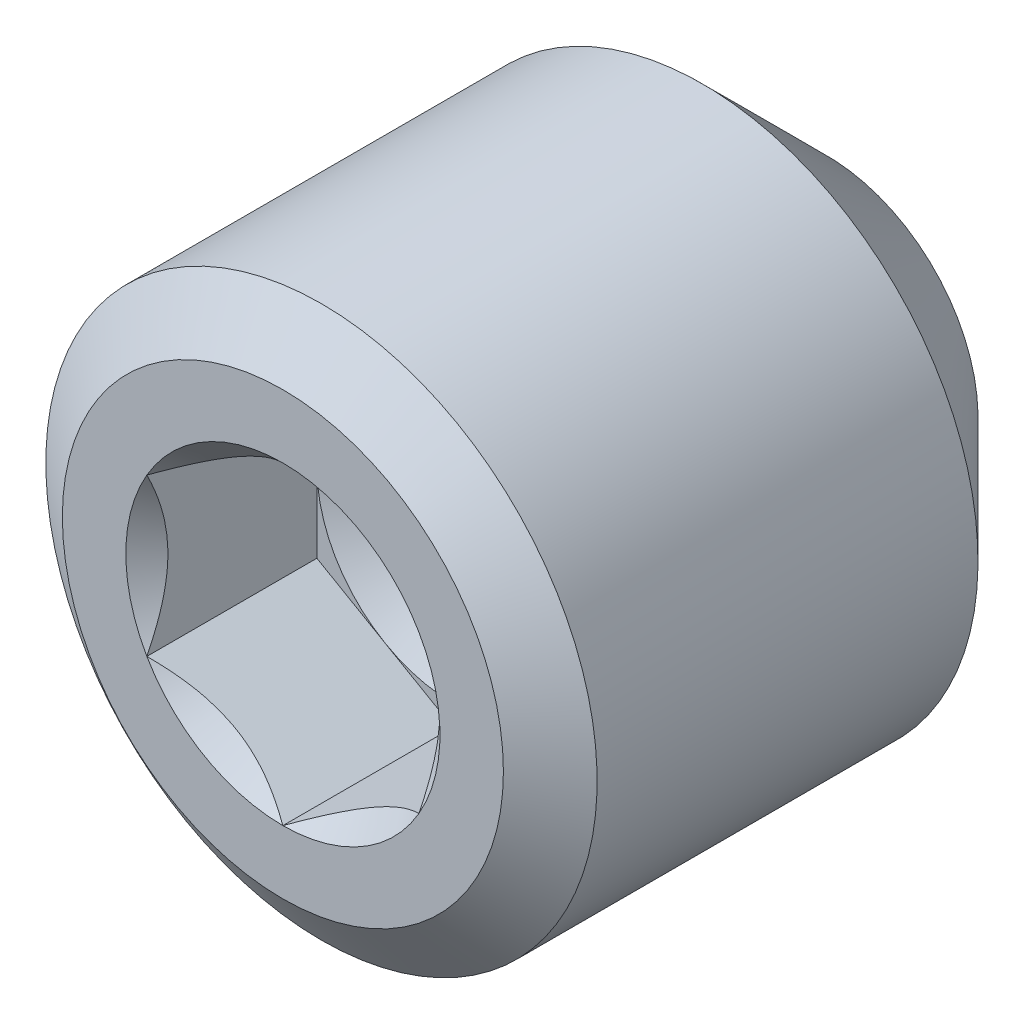
ISO-10303-21;
HEADER;
FILE_DESCRIPTION(('STEP AP214'),'2;1');
FILE_NAME('part.step','',(''),(''),'','','');
FILE_SCHEMA(('AUTOMOTIVE_DESIGN { 1 0 10303 214 1 1 1 1 }'));
ENDSEC;
DATA;
#1=APPLICATION_CONTEXT('core data for automotive mechanical design processes');
#2=APPLICATION_PROTOCOL_DEFINITION('international standard','automotive_design',2000,#1);
#3=PRODUCT_CONTEXT('',#1,'mechanical');
#4=PRODUCT('Part','Part','',(#3));
#5=PRODUCT_RELATED_PRODUCT_CATEGORY('part','',(#4));
#6=PRODUCT_DEFINITION_FORMATION('','',#4);
#7=PRODUCT_DEFINITION_CONTEXT('part definition',#1,'design');
#8=PRODUCT_DEFINITION('design','',#6,#7);
#9=PRODUCT_DEFINITION_SHAPE('','',#8);
#10=(LENGTH_UNIT() NAMED_UNIT(*) SI_UNIT(.MILLI.,.METRE.));
#11=(NAMED_UNIT(*) PLANE_ANGLE_UNIT() SI_UNIT($,.RADIAN.));
#12=(NAMED_UNIT(*) SI_UNIT($,.STERADIAN.) SOLID_ANGLE_UNIT());
#13=UNCERTAINTY_MEASURE_WITH_UNIT(LENGTH_MEASURE(1.E-05),#10,'distance_accuracy_value','');
#14=(GEOMETRIC_REPRESENTATION_CONTEXT(3) GLOBAL_UNCERTAINTY_ASSIGNED_CONTEXT((#13)) GLOBAL_UNIT_ASSIGNED_CONTEXT((#10,
#11,#12)) REPRESENTATION_CONTEXT('',''));
#15=CARTESIAN_POINT('',(0.,0.,0.));
#16=DIRECTION('',(0.,0.,1.));
#17=DIRECTION('',(1.,0.,0.));
#18=AXIS2_PLACEMENT_3D('',#15,#16,#17);
#19=CARTESIAN_POINT('',(0.,0.,0.495727982126937));
#20=DIRECTION('',(0.,0.,1.));
#21=DIRECTION('',(0.,-1.,0.));
#22=AXIS2_PLACEMENT_3D('',#19,#20,#21);
#23=CONICAL_SURFACE('',#22,1.19062499987876,1.04719755103086);
#24=CARTESIAN_POINT('',(2.55795384873636E-10,0.,-0.19167968210354));
#25=VERTEX_POINT('',#24);
#26=VERTEX_LOOP('',#25);
#27=FACE_BOUND('',#26,.T.);
#28=CARTESIAN_POINT('',(0.,0.,0.495727982192574));
#29=DIRECTION('',(0.,0.,1.));
#30=DIRECTION('',(0.,-1.,0.));
#31=AXIS2_PLACEMENT_3D('',#28,#29,#30);
#32=CIRCLE('',#31,1.19062499999245);
#33=CARTESIAN_POINT('',(1.19062499999623,0.,0.495727982183542));
#34=VERTEX_POINT('',#33);
#35=CARTESIAN_POINT('',(0.595312499998112,-1.03111149637757,0.495727982183542));
#36=VERTEX_POINT('',#35);
#37=EDGE_CURVE('E100',#34,#36,#32,.F.);
#38=ORIENTED_EDGE('',*,*,#37,.F.);
#39=CARTESIAN_POINT('',(0.,0.,0.495727982192574));
#40=DIRECTION('',(0.,0.,1.));
#41=DIRECTION('',(0.,-1.,0.));
#42=AXIS2_PLACEMENT_3D('',#39,#40,#41);
#43=CIRCLE('',#42,1.19062499999245);
#44=CARTESIAN_POINT('',(0.59531249999812,1.03111149637759,0.495727982183542));
#45=VERTEX_POINT('',#44);
#46=EDGE_CURVE('E114',#45,#34,#43,.F.);
#47=ORIENTED_EDGE('',*,*,#46,.F.);
#48=CARTESIAN_POINT('',(0.,0.,0.495727982192574));
#49=DIRECTION('',(0.,0.,1.));
#50=DIRECTION('',(0.,-1.,0.));
#51=AXIS2_PLACEMENT_3D('',#48,#49,#50);
#52=CIRCLE('',#51,1.19062499999245);
#53=CARTESIAN_POINT('',(-0.595312499998102,1.0311114963776,0.495727982183538));
#54=VERTEX_POINT('',#53);
#55=EDGE_CURVE('E255',#54,#45,#52,.F.);
#56=ORIENTED_EDGE('',*,*,#55,.F.);
#57=CARTESIAN_POINT('',(0.,0.,0.495727982192574));
#58=DIRECTION('',(0.,0.,1.));
#59=DIRECTION('',(0.,-1.,0.));
#60=AXIS2_PLACEMENT_3D('',#57,#58,#59);
#61=CIRCLE('',#60,1.19062499999245);
#62=CARTESIAN_POINT('',(-1.19062499999622,1.30013777685213E-13,0.495727982183538));
#63=VERTEX_POINT('',#62);
#64=EDGE_CURVE('E151',#63,#54,#61,.F.);
#65=ORIENTED_EDGE('',*,*,#64,.F.);
#66=CARTESIAN_POINT('',(0.,0.,0.495727982192574));
#67=DIRECTION('',(0.,0.,1.));
#68=DIRECTION('',(0.,-1.,0.));
#69=AXIS2_PLACEMENT_3D('',#66,#67,#68);
#70=CIRCLE('',#69,1.19062499999245);
#71=CARTESIAN_POINT('',(-0.595312499998087,-1.03111149637758,0.495727982183542));
#72=VERTEX_POINT('',#71);
#73=EDGE_CURVE('E19',#72,#63,#70,.F.);
#74=ORIENTED_EDGE('',*,*,#73,.F.);
#75=CARTESIAN_POINT('',(0.,0.,0.495727982192574));
#76=DIRECTION('',(0.,0.,1.));
#77=DIRECTION('',(0.,-1.,0.));
#78=AXIS2_PLACEMENT_3D('',#75,#76,#77);
#79=CIRCLE('',#78,1.19062499999245);
#80=EDGE_CURVE('E379',#36,#72,#79,.F.);
#81=ORIENTED_EDGE('',*,*,#80,.F.);
#82=EDGE_LOOP('',(#38,#47,#56,#65,#74,#81));
#83=FACE_BOUND('',#82,.T.);
#84=ADVANCED_FACE('F16',(#27,#83),#23,.F.);
#85=CARTESIAN_POINT('',(-1.190625,2.06222299276171,0.49572798217451));
#86=DIRECTION('',(0.,0.,1.));
#87=DIRECTION('',(0.,-1.,0.));
#88=AXIS2_PLACEMENT_3D('',#85,#86,#87);
#89=PLANE('',#88);
#90=DIRECTION('',(0.,-1.,0.));
#91=VECTOR('',#90,1.);
#92=CARTESIAN_POINT('',(-1.190625,0.687407664253913,0.49572798217451));
#93=LINE('',#92,#91);
#94=CARTESIAN_POINT('',(-1.19062500000001,-0.687407664253882,0.49572798217451));
#95=VERTEX_POINT('',#94);
#96=EDGE_CURVE('E83',#63,#95,#93,.T.);
#97=ORIENTED_EDGE('',*,*,#96,.T.);
#98=DIRECTION('',(0.866025403784438,-0.500000000000001,0.));
#99=VECTOR('',#98,1.);
#100=CARTESIAN_POINT('',(-1.190625,-0.687407664253889,0.49572798217451));
#101=LINE('',#100,#99);
#102=EDGE_CURVE('E167',#95,#72,#101,.T.);
#103=ORIENTED_EDGE('',*,*,#102,.T.);
#104=ORIENTED_EDGE('',*,*,#73,.T.);
#105=EDGE_LOOP('',(#97,#103,#104));
#106=FACE_BOUND('',#105,.T.);
#107=ADVANCED_FACE('F272',(#106),#89,.T.);
#108=CARTESIAN_POINT('',(-1.190625,2.06222299276171,0.49572798217451));
#109=DIRECTION('',(0.,0.,1.));
#110=DIRECTION('',(0.,-1.,0.));
#111=AXIS2_PLACEMENT_3D('',#108,#109,#110);
#112=PLANE('',#111);
#113=DIRECTION('',(0.866025403784438,-0.500000000000001,0.));
#114=VECTOR('',#113,1.);
#115=CARTESIAN_POINT('',(-1.190625,-0.687407664253889,0.495727982174503));
#116=LINE('',#115,#114);
#117=CARTESIAN_POINT('',(0.,-1.37481532850779,0.495727982174507));
#118=VERTEX_POINT('',#117);
#119=EDGE_CURVE('E133',#72,#118,#116,.T.);
#120=ORIENTED_EDGE('',*,*,#119,.T.);
#121=DIRECTION('',(0.866025403784439,0.5,0.));
#122=VECTOR('',#121,1.);
#123=CARTESIAN_POINT('',(0.,-1.37481532850779,0.49572798217451));
#124=LINE('',#123,#122);
#125=EDGE_CURVE('E105',#118,#36,#124,.T.);
#126=ORIENTED_EDGE('',*,*,#125,.T.);
#127=ORIENTED_EDGE('',*,*,#80,.T.);
#128=EDGE_LOOP('',(#120,#126,#127));
#129=FACE_BOUND('',#128,.T.);
#130=ADVANCED_FACE('F270',(#129),#112,.T.);
#131=CARTESIAN_POINT('',(-1.190625,2.06222299276171,0.49572798217451));
#132=DIRECTION('',(0.,0.,1.));
#133=DIRECTION('',(0.,-1.,0.));
#134=AXIS2_PLACEMENT_3D('',#131,#132,#133);
#135=PLANE('',#134);
#136=DIRECTION('',(0.866025403784439,0.5,0.));
#137=VECTOR('',#136,1.);
#138=CARTESIAN_POINT('',(0.,-1.37481532850779,0.49572798217451));
#139=LINE('',#138,#137);
#140=CARTESIAN_POINT('',(1.19062500000001,-0.687407664253884,0.49572798217451));
#141=VERTEX_POINT('',#140);
#142=EDGE_CURVE('E95',#36,#141,#139,.T.);
#143=ORIENTED_EDGE('',*,*,#142,.T.);
#144=DIRECTION('',(0.,1.,0.));
#145=VECTOR('',#144,1.);
#146=CARTESIAN_POINT('',(1.19062500000001,-0.687407664253889,0.49572798217451));
#147=LINE('',#146,#145);
#148=EDGE_CURVE('E98',#141,#34,#147,.T.);
#149=ORIENTED_EDGE('',*,*,#148,.T.);
#150=ORIENTED_EDGE('',*,*,#37,.T.);
#151=EDGE_LOOP('',(#143,#149,#150));
#152=FACE_BOUND('',#151,.T.);
#153=ADVANCED_FACE('F97',(#152),#135,.T.);
#154=CARTESIAN_POINT('',(-1.190625,2.06222299276171,0.49572798217451));
#155=DIRECTION('',(0.,0.,1.));
#156=DIRECTION('',(0.,-1.,0.));
#157=AXIS2_PLACEMENT_3D('',#154,#155,#156);
#158=PLANE('',#157);
#159=DIRECTION('',(0.,1.,0.));
#160=VECTOR('',#159,1.);
#161=CARTESIAN_POINT('',(1.19062500000001,-0.687407664253889,0.495727982174509));
#162=LINE('',#161,#160);
#163=CARTESIAN_POINT('',(1.19062500000003,0.687407664253898,0.495727982174509));
#164=VERTEX_POINT('',#163);
#165=EDGE_CURVE('E113',#34,#164,#162,.T.);
#166=ORIENTED_EDGE('',*,*,#165,.T.);
#167=DIRECTION('',(-0.866025403784438,0.500000000000001,0.));
#168=VECTOR('',#167,1.);
#169=CARTESIAN_POINT('',(1.19062500000001,0.687407664253913,0.49572798217451));
#170=LINE('',#169,#168);
#171=EDGE_CURVE('E124',#164,#45,#170,.T.);
#172=ORIENTED_EDGE('',*,*,#171,.T.);
#173=ORIENTED_EDGE('',*,*,#46,.T.);
#174=EDGE_LOOP('',(#166,#172,#173));
#175=FACE_BOUND('',#174,.T.);
#176=ADVANCED_FACE('F263',(#175),#158,.T.);
#177=CARTESIAN_POINT('',(1.19062500000001,-0.687407664253889,0.49572798217451));
#178=DIRECTION('',(1.,0.,0.));
#179=DIRECTION('',(0.,1.,0.));
#180=AXIS2_PLACEMENT_3D('',#177,#178,#179);
#181=PLANE('',#180);
#182=CARTESIAN_POINT('',(1.19062499999567,0.687407664292412,1.98400923211493));
#183=CARTESIAN_POINT('',(1.19062499999845,0.64046328207789,1.96055894231477));
#184=CARTESIAN_POINT('',(1.19062499999959,0.592738991388445,1.9384779182468));
#185=CARTESIAN_POINT('',(1.19062500000044,0.495406225216116,1.89800295513959));
#186=CARTESIAN_POINT('',(1.19062500000013,0.44578762950972,1.87963356850329));
#187=CARTESIAN_POINT('',(1.1906249999999,0.345116375712698,1.84791358583569));
#188=CARTESIAN_POINT('',(1.19062499999999,0.294069215443057,1.83454600462254));
#189=CARTESIAN_POINT('',(1.19062500000004,0.190855854638069,1.81396603547193));
#190=CARTESIAN_POINT('',(1.19062500000002,0.138693632939681,1.80673461351588));
#191=CARTESIAN_POINT('',(1.19062500000001,0.0719511128628457,1.80190389372895));
#192=CARTESIAN_POINT('',(1.19062500000001,0.0575681065477679,1.80112291749238));
#193=CARTESIAN_POINT('',(1.19062500000001,0.0287907386471924,1.80008032792779));
#194=CARTESIAN_POINT('',(1.19062500000001,0.0143963874866042,1.79981843246661));
#195=CARTESIAN_POINT('',(1.19062500000001,-0.0361321030513867,1.79982008619966));
#196=CARTESIAN_POINT('',(1.19062500000001,-0.0722770331511759,1.80147394594884));
#197=CARTESIAN_POINT('',(1.19062500000001,-0.144284982609329,1.80799116289963));
#198=CARTESIAN_POINT('',(1.19062500000001,-0.180147787674807,1.81285675864882));
#199=CARTESIAN_POINT('',(1.19062500000001,-0.287258251714067,1.83196696983393));
#200=CARTESIAN_POINT('',(1.19062500000001,-0.35772529740189,1.85072176782421));
#201=CARTESIAN_POINT('',(1.19062500000001,-0.471552892507442,1.88908925370762));
#202=CARTESIAN_POINT('',(1.19062500000001,-0.515840765958847,1.90614997876308));
#203=CARTESIAN_POINT('',(1.19062500000001,-0.602739573147029,1.94312607455083));
#204=CARTESIAN_POINT('',(1.19062500000001,-0.645362139970547,1.96301390794479));
#205=CARTESIAN_POINT('',(1.19062500000001,-0.687407664293118,1.98400923211292));
#206=B_SPLINE_CURVE_WITH_KNOTS('',3,(#182,#183,#184,#185,#186,#187,#188,#189,#190,#191,#192,
#193,#194,#195,#196,#197,#198,#199,#200,#201,#202,#203,#204,#205),.UNSPECIFIED.,.F.,.F.,(4,2,2,
2,2,2,2,2,2,2,2,4),(0.,0.157535403142992,0.316081041540045,0.474083294698365,0.631593623243647,
0.674799715139207,0.717982317014592,0.826362160391399,0.934817623300469,1.15262451060987,
1.29491478060776,1.43590359051227),.UNSPECIFIED.);
#207=CARTESIAN_POINT('',(1.19062500005789,0.687407664240221,1.98400923213658));
#208=VERTEX_POINT('',#207);
#209=CARTESIAN_POINT('',(1.19062500002894,-0.687407664270611,1.98400923212671));
#210=VERTEX_POINT('',#209);
#211=EDGE_CURVE('E159',#208,#210,#206,.T.);
#212=ORIENTED_EDGE('',*,*,#211,.F.);
#213=DIRECTION('',(0.,0.,1.));
#214=VECTOR('',#213,1.);
#215=CARTESIAN_POINT('',(1.19062500000003,0.687407664253898,0.49572798217451));
#216=LINE('',#215,#214);
#217=EDGE_CURVE('E139',#208,#164,#216,.F.);
#218=ORIENTED_EDGE('',*,*,#217,.T.);
#219=ORIENTED_EDGE('',*,*,#165,.F.);
#220=ORIENTED_EDGE('',*,*,#148,.F.);
#221=DIRECTION('',(0.,0.,1.));
#222=VECTOR('',#221,1.);
#223=CARTESIAN_POINT('',(1.19062500000001,-0.687407664253884,0.49572798217451));
#224=LINE('',#223,#222);
#225=EDGE_CURVE('E104',#141,#210,#224,.T.);
#226=ORIENTED_EDGE('',*,*,#225,.T.);
#227=EDGE_LOOP('',(#212,#218,#219,#220,#226));
#228=FACE_BOUND('',#227,.T.);
#229=ADVANCED_FACE('F110',(#228),#181,.F.);
#230=CARTESIAN_POINT('',(-1.190625,2.06222299276171,0.49572798217451));
#231=DIRECTION('',(0.,0.,1.));
#232=DIRECTION('',(0.,-1.,0.));
#233=AXIS2_PLACEMENT_3D('',#230,#231,#232);
#234=PLANE('',#233);
#235=DIRECTION('',(-0.866025403784438,0.500000000000001,0.));
#236=VECTOR('',#235,1.);
#237=CARTESIAN_POINT('',(1.19062500000001,0.687407664253913,0.495727982174503));
#238=LINE('',#237,#236);
#239=CARTESIAN_POINT('',(0.,1.37481532850782,0.495727982174503));
#240=VERTEX_POINT('',#239);
#241=EDGE_CURVE('E136',#45,#240,#238,.T.);
#242=ORIENTED_EDGE('',*,*,#241,.T.);
#243=DIRECTION('',(-0.866025403784439,-0.5,0.));
#244=VECTOR('',#243,1.);
#245=CARTESIAN_POINT('',(0.,1.37481532850781,0.495727982174503));
#246=LINE('',#245,#244);
#247=EDGE_CURVE('E142',#240,#54,#246,.T.);
#248=ORIENTED_EDGE('',*,*,#247,.T.);
#249=ORIENTED_EDGE('',*,*,#55,.T.);
#250=EDGE_LOOP('',(#242,#248,#249));
#251=FACE_BOUND('',#250,.T.);
#252=ADVANCED_FACE('F262',(#251),#234,.T.);
#253=CARTESIAN_POINT('',(-1.190625,2.06222299276171,0.49572798217451));
#254=DIRECTION('',(0.,0.,1.));
#255=DIRECTION('',(0.,-1.,0.));
#256=AXIS2_PLACEMENT_3D('',#253,#254,#255);
#257=PLANE('',#256);
#258=DIRECTION('',(-0.866025403784439,-0.5,0.));
#259=VECTOR('',#258,1.);
#260=CARTESIAN_POINT('',(0.,1.37481532850781,0.495727982174501));
#261=LINE('',#260,#259);
#262=CARTESIAN_POINT('',(-1.190625,0.687407664253916,0.495727982174502));
#263=VERTEX_POINT('',#262);
#264=EDGE_CURVE('E145',#54,#263,#261,.T.);
#265=ORIENTED_EDGE('',*,*,#264,.T.);
#266=DIRECTION('',(0.,-1.,0.));
#267=VECTOR('',#266,1.);
#268=CARTESIAN_POINT('',(-1.190625,0.687407664253913,0.495727982174503));
#269=LINE('',#268,#267);
#270=EDGE_CURVE('E148',#263,#63,#269,.T.);
#271=ORIENTED_EDGE('',*,*,#270,.T.);
#272=ORIENTED_EDGE('',*,*,#64,.T.);
#273=EDGE_LOOP('',(#265,#271,#272));
#274=FACE_BOUND('',#273,.T.);
#275=ADVANCED_FACE('F365',(#274),#257,.T.);
#276=CARTESIAN_POINT('',(-1.190625,0.687407664253913,0.495727982174503));
#277=DIRECTION('',(-1.,0.,0.));
#278=DIRECTION('',(0.,-1.,0.));
#279=AXIS2_PLACEMENT_3D('',#276,#277,#278);
#280=PLANE('',#279);
#281=CARTESIAN_POINT('',(-1.19062499999689,0.687407664295069,1.98400923211557));
#282=CARTESIAN_POINT('',(-1.19062499999888,0.640154592187732,1.96040536744382));
#283=CARTESIAN_POINT('',(-1.1906249999997,0.592111444465279,1.93818802847305));
#284=CARTESIAN_POINT('',(-1.1906250000003,0.494146535985991,1.89750902941694));
#285=CARTESIAN_POINT('',(-1.19062500000008,0.444215463852093,1.87906999571823));
#286=CARTESIAN_POINT('',(-1.19062499999992,0.34353191261821,1.84748380274731));
#287=CARTESIAN_POINT('',(-1.19062499999998,0.292805060660136,1.83425727427473));
#288=CARTESIAN_POINT('',(-1.19062500000002,0.19023488957445,1.81387930355028));
#289=CARTESIAN_POINT('',(-1.190625,0.138394701629495,1.80671265556526));
#290=CARTESIAN_POINT('',(-1.19062499999999,0.0490434171471756,1.80024610055994));
#291=CARTESIAN_POINT('',(-1.190625,0.0116476312291625,1.79928918177737));
#292=CARTESIAN_POINT('',(-1.190625,-0.0630781169061416,1.80090396128143));
#293=CARTESIAN_POINT('',(-1.190625,-0.100408062759505,1.80347643902957));
#294=CARTESIAN_POINT('',(-1.190625,-0.174707550763351,1.81200130363095));
#295=CARTESIAN_POINT('',(-1.190625,-0.211676725216807,1.81795683341918));
#296=CARTESIAN_POINT('',(-1.190625,-0.284997830944034,1.83292705321312));
#297=CARTESIAN_POINT('',(-1.190625,-0.321349490320898,1.84194305589422));
#298=CARTESIAN_POINT('',(-1.190625,-0.414409407701737,1.86868846791361));
#299=CARTESIAN_POINT('',(-1.190625,-0.47053205911329,1.88842523325998));
#300=CARTESIAN_POINT('',(-1.190625,-0.580581647456373,1.93288237138799));
#301=CARTESIAN_POINT('',(-1.190625,-0.634515062273283,1.95758652132262));
#302=CARTESIAN_POINT('',(-1.190625,-0.687407664295433,1.98400923211406));
#303=B_SPLINE_CURVE_WITH_KNOTS('',3,(#281,#282,#283,#284,#285,#286,#287,#288,#289,#290,#291,
#292,#293,#294,#295,#296,#297,#298,#299,#300,#301,#302),.UNSPECIFIED.,.F.,.F.,(4,2,2,2,2,2,2,2,
2,2,4),(0.,0.158570945782174,0.318065397827539,0.475027617267219,0.631594801071171,
0.743660160759135,0.855750273884749,0.967944692071428,1.08018729279008,1.25836291045195,
1.43596581394394),.UNSPECIFIED.);
#304=CARTESIAN_POINT('',(-1.19062500002893,0.687407664270642,1.98400923212671));
#305=VERTEX_POINT('',#304);
#306=CARTESIAN_POINT('',(-1.19062500005789,-0.687407664241365,1.98400923213716));
#307=VERTEX_POINT('',#306);
#308=EDGE_CURVE('E317',#305,#307,#303,.T.);
#309=ORIENTED_EDGE('',*,*,#308,.T.);
#310=DIRECTION('',(0.,0.,1.));
#311=VECTOR('',#310,1.);
#312=CARTESIAN_POINT('',(-1.19062500000001,-0.687407664253882,0.49572798217451));
#313=LINE('',#312,#311);
#314=EDGE_CURVE('E131',#307,#95,#313,.F.);
#315=ORIENTED_EDGE('',*,*,#314,.T.);
#316=ORIENTED_EDGE('',*,*,#96,.F.);
#317=ORIENTED_EDGE('',*,*,#270,.F.);
#318=DIRECTION('',(0.,0.,1.));
#319=VECTOR('',#318,1.);
#320=CARTESIAN_POINT('',(-1.190625,0.687407664253916,0.495727982174503));
#321=LINE('',#320,#319);
#322=EDGE_CURVE('E155',#263,#305,#321,.T.);
#323=ORIENTED_EDGE('',*,*,#322,.T.);
#324=EDGE_LOOP('',(#309,#315,#316,#317,#323));
#325=FACE_BOUND('',#324,.T.);
#326=ADVANCED_FACE('F336',(#325),#280,.F.);
#327=CARTESIAN_POINT('',(-1.190625,-0.687407664253889,0.49572798217451));
#328=DIRECTION('',(-0.500000000000001,-0.866025403784438,0.));
#329=DIRECTION('',(0.866025403784438,-0.500000000000001,0.));
#330=AXIS2_PLACEMENT_3D('',#327,#328,#329);
#331=PLANE('',#330);
#332=CARTESIAN_POINT('',(-1.19062500003409,-0.687407664230629,1.98400923211556));
#333=CARTESIAN_POINT('',(-1.14970263918327,-0.711034200286016,1.96040536744382));
#334=CARTESIAN_POINT('',(-1.10809605277826,-0.73505577414795,1.93818802847304));
#335=CARTESIAN_POINT('',(-1.02325595335608,-0.784038228388114,1.89750902941694));
#336=CARTESIAN_POINT('',(-0.980014376449825,-0.809003764454871,1.87906999571824));
#337=CARTESIAN_POINT('',(-0.892819863337972,-0.859345540071674,1.84748380274731));
#338=CARTESIAN_POINT('',(-0.848889120888296,-0.884708966050761,1.83425727427474));
#339=CARTESIAN_POINT('',(-0.760060747057598,-0.93599405159364,1.81387930355029));
#340=CARTESIAN_POINT('',(-0.7151658273603,-0.961914145566103,1.80671265556527));
#341=CARTESIAN_POINT('',(-0.637785345137838,-1.00658978780726,1.80024610055994));
#342=CARTESIAN_POINT('',(-0.605399644538355,-1.02528768076626,1.79928918177737));
#343=CARTESIAN_POINT('',(-0.540685248336385,-1.06265055483392,1.80090396128143));
#344=CARTESIAN_POINT('',(-0.508356566905474,-1.0813155277606,1.80347643902958));
#345=CARTESIAN_POINT('',(-0.444011322805966,-1.11846527176252,1.81200130363096));
#346=CARTESIAN_POINT('',(-0.411995078572333,-1.13694985898925,1.81795683341919));
#347=CARTESIAN_POINT('',(-0.348497138378991,-1.17361041185286,1.83292705321313));
#348=CARTESIAN_POINT('',(-0.317015677888907,-1.1917862415413,1.84194305589423));
#349=CARTESIAN_POINT('',(-0.23642342536302,-1.23831620023172,1.86868846791362));
#350=CARTESIAN_POINT('',(-0.187819783512878,-1.26637752593749,1.88842523325998));
#351=CARTESIAN_POINT('',(-0.0925140443317499,-1.32140232010903,1.932882371388));
#352=CARTESIAN_POINT('',(-0.0458063369874632,-1.34836902751749,1.95758652132262));
#353=CARTESIAN_POINT('',(3.59776575595635E-11,-1.37481532852856,1.98400923211406));
#354=B_SPLINE_CURVE_WITH_KNOTS('',3,(#332,#333,#334,#335,#336,#337,#338,#339,#340,#341,#342,
#343,#344,#345,#346,#347,#348,#349,#350,#351,#352,#353),.UNSPECIFIED.,.F.,.F.,(4,2,2,2,2,2,2,2,
2,2,4),(0.,0.158570945782172,0.318065397827535,0.475027617267213,0.631594801071163,
0.743660160759127,0.855750273884742,0.967944692071422,1.08018729279007,1.25836291045194,
1.43596581394393),.UNSPECIFIED.);
#355=CARTESIAN_POINT('',(-3.97893440011964E-11,-1.37481532855166,1.98400923213716));
#356=VERTEX_POINT('',#355);
#357=EDGE_CURVE('E322',#307,#356,#354,.T.);
#358=ORIENTED_EDGE('',*,*,#357,.T.);
#359=DIRECTION('',(0.,0.,1.));
#360=VECTOR('',#359,1.);
#361=CARTESIAN_POINT('',(0.,-1.3748153285078,0.49572798217451));
#362=LINE('',#361,#360);
#363=EDGE_CURVE('E121',#356,#118,#362,.F.);
#364=ORIENTED_EDGE('',*,*,#363,.T.);
#365=ORIENTED_EDGE('',*,*,#119,.F.);
#366=ORIENTED_EDGE('',*,*,#102,.F.);
#367=ORIENTED_EDGE('',*,*,#314,.F.);
#368=EDGE_LOOP('',(#358,#364,#365,#366,#367));
#369=FACE_BOUND('',#368,.T.);
#370=ADVANCED_FACE('F358',(#369),#331,.F.);
#371=CARTESIAN_POINT('',(0.,-1.37481532850779,0.49572798217451));
#372=DIRECTION('',(0.5,-0.866025403784439,0.));
#373=DIRECTION('',(0.866025403784439,0.5,0.));
#374=AXIS2_PLACEMENT_3D('',#371,#372,#373);
#375=PLANE('',#374);
#376=CARTESIAN_POINT('',(-3.7187299035962E-11,-1.37481532852568,1.98400923211557));
#377=CARTESIAN_POINT('',(0.0409223608156151,-1.35118879247373,1.96040536744382));
#378=CARTESIAN_POINT('',(0.0825289472214342,-1.32716721861321,1.93818802847305));
#379=CARTESIAN_POINT('',(0.167369046644212,-1.27818476437409,1.89750902941694));
#380=CARTESIAN_POINT('',(0.210610623550247,-1.25321922830695,1.87906999571824));
#381=CARTESIAN_POINT('',(0.297805136661942,-1.20287745268987,1.84748380274731));
#382=CARTESIAN_POINT('',(0.341735879111678,-1.17751402671088,1.83425727427474));
#383=CARTESIAN_POINT('',(0.430564252942422,-1.12622894116808,1.81387930355029));
#384=CARTESIAN_POINT('',(0.475459172639706,-1.10030884719558,1.80671265556527));
#385=CARTESIAN_POINT('',(0.552839654862164,-1.05563320495441,1.80024610055994));
#386=CARTESIAN_POINT('',(0.58522535546165,-1.03693531199541,1.79928918177737));
#387=CARTESIAN_POINT('',(0.649939751663623,-0.999572437927758,1.80090396128143));
#388=CARTESIAN_POINT('',(0.682268433094534,-0.980907465001075,1.80347643902958));
#389=CARTESIAN_POINT('',(0.746613677194042,-0.943757720999152,1.81200130363096));
#390=CARTESIAN_POINT('',(0.778629921427674,-0.925273133772424,1.81795683341919));
#391=CARTESIAN_POINT('',(0.842127861621015,-0.888612580908812,1.83292705321313));
#392=CARTESIAN_POINT('',(0.873609322111098,-0.87043675122038,1.84194305589423));
#393=CARTESIAN_POINT('',(0.954201574636604,-0.82390679253018,1.86868846791349));
#394=CARTESIAN_POINT('',(1.00280521648638,-0.795845466824616,1.88842523325968));
#395=CARTESIAN_POINT('',(1.0981109556668,-0.740820672653482,1.93288237138728));
#396=CARTESIAN_POINT('',(1.14481866301075,-0.713853965245223,1.95758652132166));
#397=CARTESIAN_POINT('',(1.19062500003387,-0.687407664234335,1.98400923211284));
#398=B_SPLINE_CURVE_WITH_KNOTS('',3,(#376,#377,#378,#379,#380,#381,#382,#383,#384,#385,#386,
#387,#388,#389,#390,#391,#392,#393,#394,#395,#396,#397),.UNSPECIFIED.,.F.,.F.,(4,2,2,2,2,2,2,2,
2,2,4),(0.,0.158570945782166,0.318065397827523,0.475027617267209,0.631594801071167,
0.743660160759134,0.855750273884751,0.967944692071429,1.08018729279008,1.25836291045058,
1.43596581394121),.UNSPECIFIED.);
#399=EDGE_CURVE('E119',#356,#210,#398,.T.);
#400=ORIENTED_EDGE('',*,*,#399,.T.);
#401=ORIENTED_EDGE('',*,*,#225,.F.);
#402=ORIENTED_EDGE('',*,*,#142,.F.);
#403=ORIENTED_EDGE('',*,*,#125,.F.);
#404=ORIENTED_EDGE('',*,*,#363,.F.);
#405=EDGE_LOOP('',(#400,#401,#402,#403,#404));
#406=FACE_BOUND('',#405,.T.);
#407=ADVANCED_FACE('F116',(#406),#375,.F.);
#408=CARTESIAN_POINT('',(1.19062500000001,0.687407664253913,0.49572798217451));
#409=DIRECTION('',(0.500000000000001,0.866025403784438,0.));
#410=DIRECTION('',(-0.866025403784438,0.500000000000001,0.));
#411=AXIS2_PLACEMENT_3D('',#408,#409,#410);
#412=PLANE('',#411);
#413=CARTESIAN_POINT('',(1.19062500003121,0.687407664230863,1.98400923211496));
#414=CARTESIAN_POINT('',(1.14970263918109,0.711034200286776,1.96040536744301));
#415=CARTESIAN_POINT('',(1.10809605277648,0.735055774148869,1.93818802847223));
#416=CARTESIAN_POINT('',(1.02325595335481,0.784038228389021,1.89750902941629));
#417=CARTESIAN_POINT('',(0.98001437644867,0.809003764455603,1.87906999571776));
#418=CARTESIAN_POINT('',(0.892819863337155,0.859345540072137,1.84748380274708));
#419=CARTESIAN_POINT('',(0.848889120887694,0.884708966051127,1.83425727427459));
#420=CARTESIAN_POINT('',(0.760060747057411,0.935994051593785,1.81387930355026));
#421=CARTESIAN_POINT('',(0.715165827360314,0.961914145566125,1.80671265556529));
#422=CARTESIAN_POINT('',(0.637785345138079,1.00658978780714,1.80024610055996));
#423=CARTESIAN_POINT('',(0.605399644538619,1.02528768076614,1.79928918177738));
#424=CARTESIAN_POINT('',(0.540685248336694,1.06265055483377,1.80090396128142));
#425=CARTESIAN_POINT('',(0.508356566905804,1.08131552776044,1.80347643902955));
#426=CARTESIAN_POINT('',(0.444011322806335,1.11846527176234,1.8120013036309));
#427=CARTESIAN_POINT('',(0.411995078572721,1.13694985898905,1.81795683341912));
#428=CARTESIAN_POINT('',(0.348497138379412,1.17361041185265,1.83292705321302));
#429=CARTESIAN_POINT('',(0.317015677889345,1.19178624154107,1.8419430558941));
#430=CARTESIAN_POINT('',(0.236423425363389,1.23831620023153,1.86868846791348));
#431=CARTESIAN_POINT('',(0.187819783513164,1.26637752593735,1.88842523325986));
#432=CARTESIAN_POINT('',(0.0925140443318827,1.32140232010898,1.93288237138793));
#433=CARTESIAN_POINT('',(0.0458063369875248,1.34836902751748,1.9575865213226));
#434=CARTESIAN_POINT('',(-3.59844204254258E-11,1.37481532852859,1.98400923211407));
#435=B_SPLINE_CURVE_WITH_KNOTS('',3,(#413,#414,#415,#416,#417,#418,#419,#420,#421,#422,#423,
#424,#425,#426,#427,#428,#429,#430,#431,#432,#433,#434),.UNSPECIFIED.,.F.,.F.,(4,2,2,2,2,2,2,2,
2,2,4),(0.,0.158570945781483,0.318065397826116,0.475027617265063,0.631594801068299,
0.743660160756186,0.855750273881723,0.967944692068335,1.08018729278692,1.25836291044907,
1.43596581394133),.UNSPECIFIED.);
#436=CARTESIAN_POINT('',(3.97830534634665E-11,1.37481532855168,1.98400923213717));
#437=VERTEX_POINT('',#436);
#438=EDGE_CURVE('E34',#208,#437,#435,.T.);
#439=ORIENTED_EDGE('',*,*,#438,.T.);
#440=DIRECTION('',(0.,0.,1.));
#441=VECTOR('',#440,1.);
#442=CARTESIAN_POINT('',(0.,1.37481532850782,0.495727982174503));
#443=LINE('',#442,#441);
#444=EDGE_CURVE('E315',#437,#240,#443,.F.);
#445=ORIENTED_EDGE('',*,*,#444,.T.);
#446=ORIENTED_EDGE('',*,*,#241,.F.);
#447=ORIENTED_EDGE('',*,*,#171,.F.);
#448=ORIENTED_EDGE('',*,*,#217,.F.);
#449=EDGE_LOOP('',(#439,#445,#446,#447,#448));
#450=FACE_BOUND('',#449,.T.);
#451=ADVANCED_FACE('F357',(#450),#412,.F.);
#452=CARTESIAN_POINT('',(0.,1.37481532850781,0.495727982174503));
#453=DIRECTION('',(-0.5,0.866025403784439,0.));
#454=DIRECTION('',(-0.866025403784439,-0.5,0.));
#455=AXIS2_PLACEMENT_3D('',#452,#453,#454);
#456=PLANE('',#455);
#457=CARTESIAN_POINT('',(3.7170576648238E-11,1.37481532852571,1.98400923211556));
#458=CARTESIAN_POINT('',(-0.0409223608156309,1.35118879247375,1.96040536744381));
#459=CARTESIAN_POINT('',(-0.0825289472214504,1.32716721861323,1.93818802847304));
#460=CARTESIAN_POINT('',(-0.16736904664423,1.2781847643741,1.89750902941694));
#461=CARTESIAN_POINT('',(-0.210610623550268,1.25321922830696,1.87906999571824));
#462=CARTESIAN_POINT('',(-0.297805136661962,1.20287745268989,1.84748380274731));
#463=CARTESIAN_POINT('',(-0.341735879111695,1.1775140267109,1.83425727427474));
#464=CARTESIAN_POINT('',(-0.430564252942434,1.12622894116809,1.81387930355029));
#465=CARTESIAN_POINT('',(-0.475459172639716,1.1003088471956,1.80671265556527));
#466=CARTESIAN_POINT('',(-0.552839654862171,1.05563320495443,1.80024610055995));
#467=CARTESIAN_POINT('',(-0.585225355461656,1.03693531199543,1.79928918177738));
#468=CARTESIAN_POINT('',(-0.649939751663629,0.999572437927779,1.80090396128144));
#469=CARTESIAN_POINT('',(-0.682268433094539,0.980907465001097,1.80347643902958));
#470=CARTESIAN_POINT('',(-0.746613677194047,0.943757720999173,1.81200130363096));
#471=CARTESIAN_POINT('',(-0.77862992142768,0.925273133772445,1.81795683341919));
#472=CARTESIAN_POINT('',(-0.842127861621023,0.888612580908832,1.83292705321314));
#473=CARTESIAN_POINT('',(-0.873609322111106,0.870436751220399,1.84194305589423));
#474=CARTESIAN_POINT('',(-0.954201574636989,0.823906792529982,1.86868846791362));
#475=CARTESIAN_POINT('',(-1.00280521648713,0.795845466824209,1.88842523325999));
#476=CARTESIAN_POINT('',(-1.09811095566825,0.740820672652673,1.932882371388));
#477=CARTESIAN_POINT('',(-1.14481866301253,0.713853965244221,1.95758652132262));
#478=CARTESIAN_POINT('',(-1.19062500003597,0.687407664233148,1.98400923211406));
#479=B_SPLINE_CURVE_WITH_KNOTS('',3,(#457,#458,#459,#460,#461,#462,#463,#464,#465,#466,#467,
#468,#469,#470,#471,#472,#473,#474,#475,#476,#477,#478),.UNSPECIFIED.,.F.,.F.,(4,2,2,2,2,2,2,2,
2,2,4),(0.,0.158570945782171,0.318065397827532,0.47502761726721,0.631594801071159,
0.743660160759124,0.855750273884739,0.967944692071419,1.08018729279007,1.25836291045192,
1.4359658139439),.UNSPECIFIED.);
#480=EDGE_CURVE('E207',#437,#305,#479,.T.);
#481=ORIENTED_EDGE('',*,*,#480,.T.);
#482=ORIENTED_EDGE('',*,*,#322,.F.);
#483=ORIENTED_EDGE('',*,*,#264,.F.);
#484=ORIENTED_EDGE('',*,*,#247,.F.);
#485=ORIENTED_EDGE('',*,*,#444,.F.);
#486=EDGE_LOOP('',(#481,#482,#483,#484,#485));
#487=FACE_BOUND('',#486,.T.);
#488=ADVANCED_FACE('F223',(#487),#456,.F.);
#489=CARTESIAN_POINT('',(0.,0.,1.98400923216013));
#490=DIRECTION('',(0.,0.,1.));
#491=DIRECTION('',(1.,0.,0.));
#492=AXIS2_PLACEMENT_3D('',#489,#490,#491);
#493=CONICAL_SURFACE('',#492,1.37481532857464,0.785398163397448);
#494=ORIENTED_EDGE('',*,*,#308,.F.);
#495=CARTESIAN_POINT('',(0.,0.,1.98400923216013));
#496=DIRECTION('',(0.,0.,1.));
#497=DIRECTION('',(1.,0.,0.));
#498=AXIS2_PLACEMENT_3D('',#495,#496,#497);
#499=CIRCLE('',#498,1.37481532857464);
#500=EDGE_CURVE('E204',#305,#307,#499,.T.);
#501=ORIENTED_EDGE('',*,*,#500,.T.);
#502=EDGE_LOOP('',(#494,#501));
#503=FACE_BOUND('',#502,.T.);
#504=ADVANCED_FACE('F318',(#503),#493,.F.);
#505=CARTESIAN_POINT('',(0.,0.,1.98400923216013));
#506=DIRECTION('',(0.,0.,1.));
#507=DIRECTION('',(1.,0.,0.));
#508=AXIS2_PLACEMENT_3D('',#505,#506,#507);
#509=CONICAL_SURFACE('',#508,1.37481532857464,0.785398163397448);
#510=ORIENTED_EDGE('',*,*,#357,.F.);
#511=CARTESIAN_POINT('',(0.,0.,1.98400923216013));
#512=DIRECTION('',(0.,0.,1.));
#513=DIRECTION('',(1.,0.,0.));
#514=AXIS2_PLACEMENT_3D('',#511,#512,#513);
#515=CIRCLE('',#514,1.37481532857464);
#516=EDGE_CURVE('E201',#307,#356,#515,.T.);
#517=ORIENTED_EDGE('',*,*,#516,.T.);
#518=EDGE_LOOP('',(#510,#517));
#519=FACE_BOUND('',#518,.T.);
#520=ADVANCED_FACE('F340',(#519),#509,.F.);
#521=CARTESIAN_POINT('',(0.,0.,1.98400923216013));
#522=DIRECTION('',(0.,0.,1.));
#523=DIRECTION('',(1.,0.,0.));
#524=AXIS2_PLACEMENT_3D('',#521,#522,#523);
#525=CONICAL_SURFACE('',#524,1.37481532857464,0.785398163397448);
#526=ORIENTED_EDGE('',*,*,#399,.F.);
#527=CARTESIAN_POINT('',(0.,0.,1.98400923216013));
#528=DIRECTION('',(0.,0.,1.));
#529=DIRECTION('',(1.,0.,0.));
#530=AXIS2_PLACEMENT_3D('',#527,#528,#529);
#531=CIRCLE('',#530,1.37481532857464);
#532=EDGE_CURVE('E199',#356,#210,#531,.T.);
#533=ORIENTED_EDGE('',*,*,#532,.T.);
#534=EDGE_LOOP('',(#526,#533));
#535=FACE_BOUND('',#534,.T.);
#536=ADVANCED_FACE('F242',(#535),#525,.F.);
#537=CARTESIAN_POINT('',(0.,0.,1.98400923216013));
#538=DIRECTION('',(0.,0.,1.));
#539=DIRECTION('',(1.,0.,0.));
#540=AXIS2_PLACEMENT_3D('',#537,#538,#539);
#541=CONICAL_SURFACE('',#540,1.37481532857464,0.785398163550834);
#542=CARTESIAN_POINT('',(0.,0.,1.98400923216013));
#543=DIRECTION('',(0.,0.,1.));
#544=DIRECTION('',(1.,0.,0.));
#545=AXIS2_PLACEMENT_3D('',#542,#543,#544);
#546=CIRCLE('',#545,1.37481532857464);
#547=EDGE_CURVE('E196',#210,#208,#546,.T.);
#548=ORIENTED_EDGE('',*,*,#547,.T.);
#549=ORIENTED_EDGE('',*,*,#211,.T.);
#550=EDGE_LOOP('',(#548,#549));
#551=FACE_BOUND('',#550,.T.);
#552=ADVANCED_FACE('F237',(#551),#541,.F.);
#553=CARTESIAN_POINT('',(0.,0.,1.98400923216013));
#554=DIRECTION('',(0.,0.,1.));
#555=DIRECTION('',(1.,0.,0.));
#556=AXIS2_PLACEMENT_3D('',#553,#554,#555);
#557=CONICAL_SURFACE('',#556,1.37481532857464,0.785398163397448);
#558=ORIENTED_EDGE('',*,*,#438,.F.);
#559=CARTESIAN_POINT('',(0.,0.,1.98400923216013));
#560=DIRECTION('',(0.,0.,1.));
#561=DIRECTION('',(1.,0.,0.));
#562=AXIS2_PLACEMENT_3D('',#559,#560,#561);
#563=CIRCLE('',#562,1.37481532857464);
#564=EDGE_CURVE('E193',#208,#437,#563,.T.);
#565=ORIENTED_EDGE('',*,*,#564,.T.);
#566=EDGE_LOOP('',(#558,#565));
#567=FACE_BOUND('',#566,.T.);
#568=ADVANCED_FACE('F231',(#567),#557,.F.);
#569=CARTESIAN_POINT('',(0.,0.,1.98400923216013));
#570=DIRECTION('',(0.,0.,1.));
#571=DIRECTION('',(1.,0.,0.));
#572=AXIS2_PLACEMENT_3D('',#569,#570,#571);
#573=CONICAL_SURFACE('',#572,1.37481532857464,0.785398163397448);
#574=ORIENTED_EDGE('',*,*,#480,.F.);
#575=CARTESIAN_POINT('',(0.,0.,1.98400923216013));
#576=DIRECTION('',(0.,0.,1.));
#577=DIRECTION('',(1.,0.,0.));
#578=AXIS2_PLACEMENT_3D('',#575,#576,#577);
#579=CIRCLE('',#578,1.37481532857464);
#580=EDGE_CURVE('E190',#437,#305,#579,.T.);
#581=ORIENTED_EDGE('',*,*,#580,.T.);
#582=EDGE_LOOP('',(#574,#581));
#583=FACE_BOUND('',#582,.T.);
#584=ADVANCED_FACE('F226',(#583),#573,.F.);
#585=CARTESIAN_POINT('',(0.,1.32223931889029,-2.77849076782551));
#586=DIRECTION('',(0.,0.,1.));
#587=DIRECTION('',(0.,-1.,0.));
#588=AXIS2_PLACEMENT_3D('',#585,#586,#587);
#589=PLANE('',#588);
#590=CARTESIAN_POINT('',(0.,0.,-2.77849076780968));
#591=DIRECTION('',(0.,0.,1.));
#592=DIRECTION('',(0.,-1.,0.));
#593=AXIS2_PLACEMENT_3D('',#590,#591,#592);
#594=CIRCLE('',#593,1.3222393188812);
#595=CARTESIAN_POINT('',(0.,-1.3222393188812,-2.77849076780967));
#596=VERTEX_POINT('',#595);
#597=EDGE_CURVE('E187',#596,#596,#594,.T.);
#598=ORIENTED_EDGE('',*,*,#597,.F.);
#599=EDGE_LOOP('',(#598));
#600=FACE_BOUND('',#599,.T.);
#601=ADVANCED_FACE('F230',(#600),#589,.F.);
#602=CARTESIAN_POINT('',(0.,0.,1.98400923217451));
#603=DIRECTION('',(0.,0.,-1.));
#604=DIRECTION('',(0.,1.,0.));
#605=AXIS2_PLACEMENT_3D('',#602,#603,#604);
#606=PLANE('',#605);
#607=CARTESIAN_POINT('',(0.,0.,1.98400923216014));
#608=DIRECTION('',(0.,0.,-1.));
#609=DIRECTION('',(0.,1.,0.));
#610=AXIS2_PLACEMENT_3D('',#607,#608,#609);
#611=CIRCLE('',#610,1.93040000004882);
#612=CARTESIAN_POINT('',(0.,1.93040000004885,1.98400923216013));
#613=VERTEX_POINT('',#612);
#614=EDGE_CURVE('E184',#613,#613,#611,.T.);
#615=ORIENTED_EDGE('',*,*,#614,.F.);
#616=EDGE_LOOP('',(#615));
#617=FACE_BOUND('',#616,.T.);
#618=ORIENTED_EDGE('',*,*,#564,.F.);
#619=ORIENTED_EDGE('',*,*,#547,.F.);
#620=ORIENTED_EDGE('',*,*,#532,.F.);
#621=ORIENTED_EDGE('',*,*,#516,.F.);
#622=ORIENTED_EDGE('',*,*,#500,.F.);
#623=ORIENTED_EDGE('',*,*,#580,.F.);
#624=EDGE_LOOP('',(#618,#619,#620,#621,#622,#623));
#625=FACE_BOUND('',#624,.T.);
#626=ADVANCED_FACE('F295',(#617,#625),#606,.F.);
#627=CARTESIAN_POINT('',(0.,0.,-1.68773008670088));
#628=DIRECTION('',(0.,0.,1.));
#629=DIRECTION('',(0.,-1.,0.));
#630=AXIS2_PLACEMENT_3D('',#627,#628,#629);
#631=CONICAL_SURFACE('',#630,2.41299999993317,0.785398163371396);
#632=CARTESIAN_POINT('',(0.,0.,-1.68773008671579));
#633=DIRECTION('',(0.,0.,1.));
#634=DIRECTION('',(0.,-1.,0.));
#635=AXIS2_PLACEMENT_3D('',#632,#633,#634);
#636=CIRCLE('',#635,2.41299999999999);
#637=CARTESIAN_POINT('',(0.,-2.41299999999999,-1.68773008671578));
#638=VERTEX_POINT('',#637);
#639=EDGE_CURVE('E25',#638,#638,#636,.T.);
#640=ORIENTED_EDGE('',*,*,#639,.F.);
#641=EDGE_LOOP('',(#640));
#642=FACE_BOUND('',#641,.T.);
#643=ORIENTED_EDGE('',*,*,#597,.T.);
#644=EDGE_LOOP('',(#643));
#645=FACE_BOUND('',#644,.T.);
#646=ADVANCED_FACE('F289',(#642,#645),#631,.T.);
#647=CARTESIAN_POINT('',(0.,0.,1.64608907419962));
#648=DIRECTION('',(0.,0.,-1.));
#649=DIRECTION('',(0.,1.,0.));
#650=AXIS2_PLACEMENT_3D('',#647,#648,#649);
#651=CONICAL_SURFACE('',#650,2.41300000004682,0.959931088566411);
#652=CARTESIAN_POINT('',(0.,0.,1.64608907423451));
#653=DIRECTION('',(0.,0.,1.));
#654=DIRECTION('',(0.,-1.,0.));
#655=AXIS2_PLACEMENT_3D('',#652,#653,#654);
#656=CIRCLE('',#655,2.41299999999999);
#657=CARTESIAN_POINT('',(0.,-2.41299999999997,1.64608907423452));
#658=VERTEX_POINT('',#657);
#659=EDGE_CURVE('E11',#658,#658,#656,.F.);
#660=ORIENTED_EDGE('',*,*,#659,.F.);
#661=EDGE_LOOP('',(#660));
#662=FACE_BOUND('',#661,.T.);
#663=ORIENTED_EDGE('',*,*,#614,.T.);
#664=EDGE_LOOP('',(#663));
#665=FACE_BOUND('',#664,.T.);
#666=ADVANCED_FACE('F283',(#662,#665),#651,.T.);
#667=CARTESIAN_POINT('',(0.,0.,-1.9840092321745));
#668=DIRECTION('',(0.,0.,1.));
#669=DIRECTION('',(0.,-1.,0.));
#670=AXIS2_PLACEMENT_3D('',#667,#668,#669);
#671=CYLINDRICAL_SURFACE('',#670,2.41299999999999);
#672=ORIENTED_EDGE('',*,*,#659,.T.);
#673=EDGE_LOOP('',(#672));
#674=FACE_BOUND('',#673,.T.);
#675=ORIENTED_EDGE('',*,*,#639,.T.);
#676=EDGE_LOOP('',(#675));
#677=FACE_BOUND('',#676,.T.);
#678=ADVANCED_FACE('F281',(#674,#677),#671,.T.);
#679=CLOSED_SHELL('',(#84,#107,#130,#153,#176,#229,#252,#275,#326,#370,#407,#451,#488,#504,#520,
#536,#552,#568,#584,#601,#626,#646,#666,#678));
#680=MANIFOLD_SOLID_BREP('B1',#679);
#681=ADVANCED_BREP_SHAPE_REPRESENTATION('',(#18,#680),#14);
#682=SHAPE_DEFINITION_REPRESENTATION(#9,#681);
ENDSEC;
END-ISO-10303-21;
